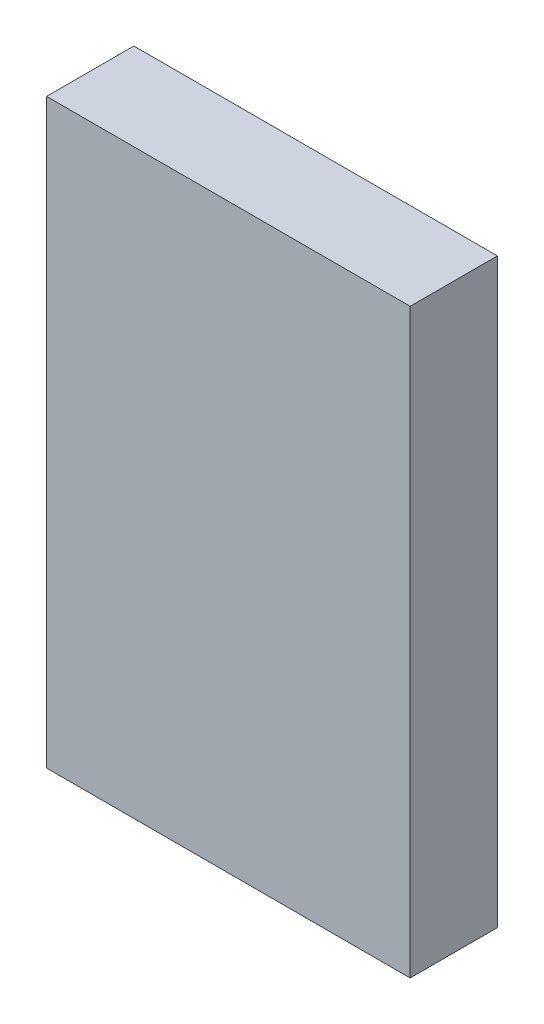
ISO-10303-21;
HEADER;
FILE_DESCRIPTION(('STEP AP214'),'2;1');
FILE_NAME('part.step','',(''),(''),'','','');
FILE_SCHEMA(('AUTOMOTIVE_DESIGN { 1 0 10303 214 1 1 1 1 }'));
ENDSEC;
DATA;
#1=APPLICATION_CONTEXT('core data for automotive mechanical design processes');
#2=APPLICATION_PROTOCOL_DEFINITION('international standard','automotive_design',2000,#1);
#3=PRODUCT_CONTEXT('',#1,'mechanical');
#4=PRODUCT('Part','Part','',(#3));
#5=PRODUCT_RELATED_PRODUCT_CATEGORY('part','',(#4));
#6=PRODUCT_DEFINITION_FORMATION('','',#4);
#7=PRODUCT_DEFINITION_CONTEXT('part definition',#1,'design');
#8=PRODUCT_DEFINITION('design','',#6,#7);
#9=PRODUCT_DEFINITION_SHAPE('','',#8);
#10=(LENGTH_UNIT() NAMED_UNIT(*) SI_UNIT(.MILLI.,.METRE.));
#11=(NAMED_UNIT(*) PLANE_ANGLE_UNIT() SI_UNIT($,.RADIAN.));
#12=(NAMED_UNIT(*) SI_UNIT($,.STERADIAN.) SOLID_ANGLE_UNIT());
#13=UNCERTAINTY_MEASURE_WITH_UNIT(LENGTH_MEASURE(1.E-05),#10,'distance_accuracy_value','');
#14=(GEOMETRIC_REPRESENTATION_CONTEXT(3) GLOBAL_UNCERTAINTY_ASSIGNED_CONTEXT((#13)) GLOBAL_UNIT_ASSIGNED_CONTEXT((#10,
#11,#12)) REPRESENTATION_CONTEXT('',''));
#15=CARTESIAN_POINT('',(0.,0.,0.));
#16=DIRECTION('',(0.,0.,1.));
#17=DIRECTION('',(1.,0.,0.));
#18=AXIS2_PLACEMENT_3D('',#15,#16,#17);
#19=CARTESIAN_POINT('',(0.62500002,-1.00000054,0.3));
#20=DIRECTION('',(0.,0.,1.));
#21=DIRECTION('',(1.,0.,0.));
#22=AXIS2_PLACEMENT_3D('',#19,#20,#21);
#23=PLANE('',#22);
#24=DIRECTION('',(0.,1.,0.));
#25=VECTOR('',#24,1.);
#26=CARTESIAN_POINT('',(-0.62499748,-1.00000054,0.3));
#27=LINE('',#26,#25);
#28=CARTESIAN_POINT('',(-0.62499748,-1.00000054,0.3));
#29=VERTEX_POINT('',#28);
#30=CARTESIAN_POINT('',(-0.62499748,1.00000054,0.3));
#31=VERTEX_POINT('',#30);
#32=EDGE_CURVE('E53',#29,#31,#27,.T.);
#33=ORIENTED_EDGE('',*,*,#32,.F.);
#34=DIRECTION('',(1.,0.,0.));
#35=VECTOR('',#34,1.);
#36=CARTESIAN_POINT('',(0.62500002,-1.00000054,0.3));
#37=LINE('',#36,#35);
#38=CARTESIAN_POINT('',(0.62500002,-1.00000054,0.3));
#39=VERTEX_POINT('',#38);
#40=EDGE_CURVE('E20',#29,#39,#37,.T.);
#41=ORIENTED_EDGE('',*,*,#40,.T.);
#42=DIRECTION('',(0.,1.,0.));
#43=VECTOR('',#42,1.);
#44=CARTESIAN_POINT('',(0.62500002,1.00000054,0.3));
#45=LINE('',#44,#43);
#46=CARTESIAN_POINT('',(0.62500002,1.00000054,0.3));
#47=VERTEX_POINT('',#46);
#48=EDGE_CURVE('E67',#47,#39,#45,.F.);
#49=ORIENTED_EDGE('',*,*,#48,.F.);
#50=DIRECTION('',(1.,0.,0.));
#51=VECTOR('',#50,1.);
#52=CARTESIAN_POINT('',(-0.62499748,1.00000054,0.3));
#53=LINE('',#52,#51);
#54=EDGE_CURVE('E58',#31,#47,#53,.T.);
#55=ORIENTED_EDGE('',*,*,#54,.F.);
#56=EDGE_LOOP('',(#33,#41,#49,#55));
#57=FACE_BOUND('',#56,.T.);
#58=ADVANCED_FACE('F17',(#57),#23,.T.);
#59=CARTESIAN_POINT('',(0.62500002,1.00000054,0.));
#60=DIRECTION('',(1.,0.,0.));
#61=DIRECTION('',(0.,0.,-1.));
#62=AXIS2_PLACEMENT_3D('',#59,#60,#61);
#63=PLANE('',#62);
#64=DIRECTION('',(0.,0.,-1.));
#65=VECTOR('',#64,1.);
#66=CARTESIAN_POINT('',(0.62500002,-1.00000054,0.));
#67=LINE('',#66,#65);
#68=CARTESIAN_POINT('',(0.62500002,-1.00000054,0.));
#69=VERTEX_POINT('',#68);
#70=EDGE_CURVE('E80',#69,#39,#67,.F.);
#71=ORIENTED_EDGE('',*,*,#70,.F.);
#72=DIRECTION('',(0.,1.,0.));
#73=VECTOR('',#72,1.);
#74=CARTESIAN_POINT('',(0.62500002,-1.00000054,0.));
#75=LINE('',#74,#73);
#76=CARTESIAN_POINT('',(0.62500002,1.00000054,0.));
#77=VERTEX_POINT('',#76);
#78=EDGE_CURVE('E75',#69,#77,#75,.T.);
#79=ORIENTED_EDGE('',*,*,#78,.T.);
#80=DIRECTION('',(0.,0.,1.));
#81=VECTOR('',#80,1.);
#82=CARTESIAN_POINT('',(0.62500002,1.00000054,0.));
#83=LINE('',#82,#81);
#84=EDGE_CURVE('E63',#47,#77,#83,.F.);
#85=ORIENTED_EDGE('',*,*,#84,.F.);
#86=ORIENTED_EDGE('',*,*,#48,.T.);
#87=EDGE_LOOP('',(#71,#79,#85,#86));
#88=FACE_BOUND('',#87,.T.);
#89=ADVANCED_FACE('F74',(#88),#63,.T.);
#90=CARTESIAN_POINT('',(-0.62499748,1.00000054,0.));
#91=DIRECTION('',(0.,1.,0.));
#92=DIRECTION('',(0.,0.,1.));
#93=AXIS2_PLACEMENT_3D('',#90,#91,#92);
#94=PLANE('',#93);
#95=ORIENTED_EDGE('',*,*,#84,.T.);
#96=DIRECTION('',(1.,0.,0.));
#97=VECTOR('',#96,1.);
#98=CARTESIAN_POINT('',(0.62500002,1.00000054,0.));
#99=LINE('',#98,#97);
#100=CARTESIAN_POINT('',(-0.62499748,1.00000054,0.));
#101=VERTEX_POINT('',#100);
#102=EDGE_CURVE('E84',#77,#101,#99,.F.);
#103=ORIENTED_EDGE('',*,*,#102,.T.);
#104=DIRECTION('',(0.,0.,1.));
#105=VECTOR('',#104,1.);
#106=CARTESIAN_POINT('',(-0.62499748,1.00000054,0.));
#107=LINE('',#106,#105);
#108=EDGE_CURVE('E65',#31,#101,#107,.F.);
#109=ORIENTED_EDGE('',*,*,#108,.F.);
#110=ORIENTED_EDGE('',*,*,#54,.T.);
#111=EDGE_LOOP('',(#95,#103,#109,#110));
#112=FACE_BOUND('',#111,.T.);
#113=ADVANCED_FACE('F60',(#112),#94,.T.);
#114=CARTESIAN_POINT('',(-0.62499748,-1.00000054,0.));
#115=DIRECTION('',(-1.,0.,0.));
#116=DIRECTION('',(0.,0.,1.));
#117=AXIS2_PLACEMENT_3D('',#114,#115,#116);
#118=PLANE('',#117);
#119=ORIENTED_EDGE('',*,*,#108,.T.);
#120=DIRECTION('',(0.,1.,0.));
#121=VECTOR('',#120,1.);
#122=CARTESIAN_POINT('',(-0.62499748,-1.00000054,0.));
#123=LINE('',#122,#121);
#124=CARTESIAN_POINT('',(-0.62499748,-1.00000054,0.));
#125=VERTEX_POINT('',#124);
#126=EDGE_CURVE('E26',#101,#125,#123,.F.);
#127=ORIENTED_EDGE('',*,*,#126,.T.);
#128=DIRECTION('',(0.,0.,-1.));
#129=VECTOR('',#128,1.);
#130=CARTESIAN_POINT('',(-0.62499748,-1.00000054,0.));
#131=LINE('',#130,#129);
#132=EDGE_CURVE('E34',#29,#125,#131,.T.);
#133=ORIENTED_EDGE('',*,*,#132,.F.);
#134=ORIENTED_EDGE('',*,*,#32,.T.);
#135=EDGE_LOOP('',(#119,#127,#133,#134));
#136=FACE_BOUND('',#135,.T.);
#137=ADVANCED_FACE('F88',(#136),#118,.T.);
#138=CARTESIAN_POINT('',(0.62500002,-1.00000054,0.));
#139=DIRECTION('',(0.,-1.,0.));
#140=DIRECTION('',(0.,0.,-1.));
#141=AXIS2_PLACEMENT_3D('',#138,#139,#140);
#142=PLANE('',#141);
#143=ORIENTED_EDGE('',*,*,#132,.T.);
#144=DIRECTION('',(1.,0.,0.));
#145=VECTOR('',#144,1.);
#146=CARTESIAN_POINT('',(0.62500002,-1.00000054,0.));
#147=LINE('',#146,#145);
#148=EDGE_CURVE('E11',#125,#69,#147,.T.);
#149=ORIENTED_EDGE('',*,*,#148,.T.);
#150=ORIENTED_EDGE('',*,*,#70,.T.);
#151=ORIENTED_EDGE('',*,*,#40,.F.);
#152=EDGE_LOOP('',(#143,#149,#150,#151));
#153=FACE_BOUND('',#152,.T.);
#154=ADVANCED_FACE('F91',(#153),#142,.T.);
#155=CARTESIAN_POINT('',(0.62500002,-1.00000054,0.));
#156=DIRECTION('',(0.,0.,1.));
#157=DIRECTION('',(1.,0.,0.));
#158=AXIS2_PLACEMENT_3D('',#155,#156,#157);
#159=PLANE('',#158);
#160=ORIENTED_EDGE('',*,*,#126,.F.);
#161=ORIENTED_EDGE('',*,*,#102,.F.);
#162=ORIENTED_EDGE('',*,*,#78,.F.);
#163=ORIENTED_EDGE('',*,*,#148,.F.);
#164=EDGE_LOOP('',(#160,#161,#162,#163));
#165=FACE_BOUND('',#164,.T.);
#166=ADVANCED_FACE('F90',(#165),#159,.F.);
#167=CLOSED_SHELL('',(#58,#89,#113,#137,#154,#166));
#168=MANIFOLD_SOLID_BREP('B1',#167);
#169=ADVANCED_BREP_SHAPE_REPRESENTATION('',(#18,#168),#14);
#170=SHAPE_DEFINITION_REPRESENTATION(#9,#169);
ENDSEC;
END-ISO-10303-21;
